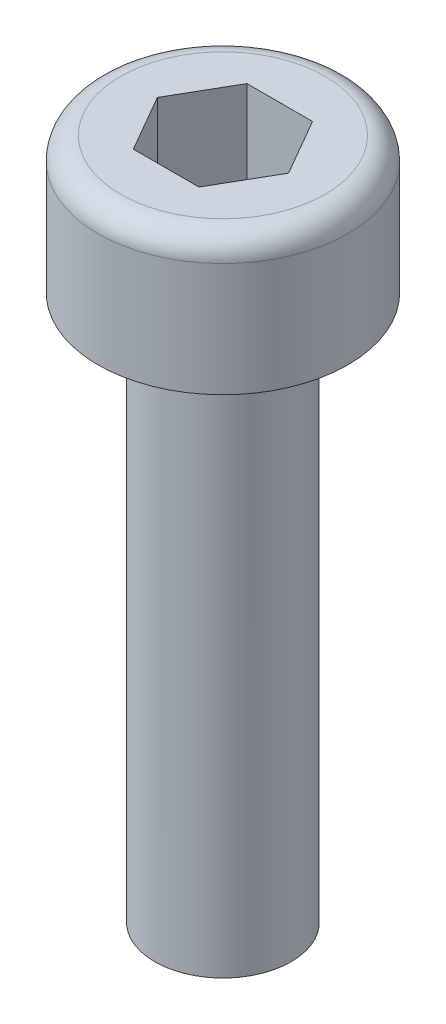
ISO-10303-21;
HEADER;
FILE_DESCRIPTION(('STEP AP214'),'2;1');
FILE_NAME('part.step','',(''),(''),'','','');
FILE_SCHEMA(('AUTOMOTIVE_DESIGN { 1 0 10303 214 1 1 1 1 }'));
ENDSEC;
DATA;
#1=APPLICATION_CONTEXT('core data for automotive mechanical design processes');
#2=APPLICATION_PROTOCOL_DEFINITION('international standard','automotive_design',2000,#1);
#3=PRODUCT_CONTEXT('',#1,'mechanical');
#4=PRODUCT('Part','Part','',(#3));
#5=PRODUCT_RELATED_PRODUCT_CATEGORY('part','',(#4));
#6=PRODUCT_DEFINITION_FORMATION('','',#4);
#7=PRODUCT_DEFINITION_CONTEXT('part definition',#1,'design');
#8=PRODUCT_DEFINITION('design','',#6,#7);
#9=PRODUCT_DEFINITION_SHAPE('','',#8);
#10=(LENGTH_UNIT() NAMED_UNIT(*) SI_UNIT(.MILLI.,.METRE.));
#11=(NAMED_UNIT(*) PLANE_ANGLE_UNIT() SI_UNIT($,.RADIAN.));
#12=(NAMED_UNIT(*) SI_UNIT($,.STERADIAN.) SOLID_ANGLE_UNIT());
#13=UNCERTAINTY_MEASURE_WITH_UNIT(LENGTH_MEASURE(1.E-05),#10,'distance_accuracy_value','');
#14=(GEOMETRIC_REPRESENTATION_CONTEXT(3) GLOBAL_UNCERTAINTY_ASSIGNED_CONTEXT((#13)) GLOBAL_UNIT_ASSIGNED_CONTEXT((#10,
#11,#12)) REPRESENTATION_CONTEXT('',''));
#15=CARTESIAN_POINT('',(0.,0.,0.));
#16=DIRECTION('',(0.,0.,1.));
#17=DIRECTION('',(1.,0.,0.));
#18=AXIS2_PLACEMENT_3D('',#15,#16,#17);
#19=CARTESIAN_POINT('',(0.,2.5,0.));
#20=DIRECTION('',(0.,-1.,0.));
#21=DIRECTION('',(1.,0.,0.));
#22=AXIS2_PLACEMENT_3D('',#19,#20,#21);
#23=TOROIDAL_SURFACE('',#22,2.25,0.5);
#24=CARTESIAN_POINT('',(0.,3.,0.));
#25=DIRECTION('',(0.,-1.,0.));
#26=DIRECTION('',(1.,0.,0.));
#27=AXIS2_PLACEMENT_3D('',#24,#25,#26);
#28=CIRCLE('',#27,2.25);
#29=CARTESIAN_POINT('',(2.25,3.,0.));
#30=VERTEX_POINT('',#29);
#31=EDGE_CURVE('E136',#30,#30,#28,.T.);
#32=ORIENTED_EDGE('',*,*,#31,.T.);
#33=EDGE_LOOP('',(#32));
#34=FACE_BOUND('',#33,.T.);
#35=CARTESIAN_POINT('',(0.,2.5,0.));
#36=DIRECTION('',(0.,-1.,0.));
#37=DIRECTION('',(1.,0.,0.));
#38=AXIS2_PLACEMENT_3D('',#35,#36,#37);
#39=CIRCLE('',#38,2.75);
#40=CARTESIAN_POINT('',(2.75,2.5,0.));
#41=VERTEX_POINT('',#40);
#42=EDGE_CURVE('E11',#41,#41,#39,.T.);
#43=ORIENTED_EDGE('',*,*,#42,.F.);
#44=EDGE_LOOP('',(#43));
#45=FACE_BOUND('',#44,.T.);
#46=ADVANCED_FACE('F33',(#34,#45),#23,.T.);
#47=CARTESIAN_POINT('',(0.,3.,0.));
#48=DIRECTION('',(0.,-1.,0.));
#49=DIRECTION('',(1.,0.,0.));
#50=AXIS2_PLACEMENT_3D('',#47,#48,#49);
#51=CYLINDRICAL_SURFACE('',#50,2.75);
#52=ORIENTED_EDGE('',*,*,#42,.T.);
#53=EDGE_LOOP('',(#52));
#54=FACE_BOUND('',#53,.T.);
#55=CARTESIAN_POINT('',(0.,0.,0.));
#56=DIRECTION('',(0.,-1.,0.));
#57=DIRECTION('',(1.,0.,0.));
#58=AXIS2_PLACEMENT_3D('',#55,#56,#57);
#59=CIRCLE('',#58,2.75);
#60=CARTESIAN_POINT('',(2.75,0.,0.));
#61=VERTEX_POINT('',#60);
#62=EDGE_CURVE('E40',#61,#61,#59,.T.);
#63=ORIENTED_EDGE('',*,*,#62,.F.);
#64=EDGE_LOOP('',(#63));
#65=FACE_BOUND('',#64,.T.);
#66=ADVANCED_FACE('F156',(#54,#65),#51,.T.);
#67=CARTESIAN_POINT('',(2.74999999999984,0.,0.));
#68=DIRECTION('',(0.,-1.,0.));
#69=DIRECTION('',(1.,0.,0.));
#70=AXIS2_PLACEMENT_3D('',#67,#68,#69);
#71=PLANE('',#70);
#72=ORIENTED_EDGE('',*,*,#62,.T.);
#73=EDGE_LOOP('',(#72));
#74=FACE_BOUND('',#73,.T.);
#75=CARTESIAN_POINT('',(0.,0.,0.));
#76=DIRECTION('',(0.,-1.,0.));
#77=DIRECTION('',(1.,0.,0.));
#78=AXIS2_PLACEMENT_3D('',#75,#76,#77);
#79=CIRCLE('',#78,1.5);
#80=CARTESIAN_POINT('',(1.5,0.,0.));
#81=VERTEX_POINT('',#80);
#82=EDGE_CURVE('E148',#81,#81,#79,.T.);
#83=ORIENTED_EDGE('',*,*,#82,.F.);
#84=EDGE_LOOP('',(#83));
#85=FACE_BOUND('',#84,.T.);
#86=ADVANCED_FACE('F153',(#74,#85),#71,.T.);
#87=CARTESIAN_POINT('',(0.,3.,0.));
#88=DIRECTION('',(0.,-1.,0.));
#89=DIRECTION('',(1.,0.,0.));
#90=AXIS2_PLACEMENT_3D('',#87,#88,#89);
#91=CYLINDRICAL_SURFACE('',#90,1.5);
#92=ORIENTED_EDGE('',*,*,#82,.T.);
#93=EDGE_LOOP('',(#92));
#94=FACE_BOUND('',#93,.T.);
#95=CARTESIAN_POINT('',(0.,-12.,0.));
#96=DIRECTION('',(0.,-1.,0.));
#97=DIRECTION('',(1.,0.,0.));
#98=AXIS2_PLACEMENT_3D('',#95,#96,#97);
#99=CIRCLE('',#98,1.5);
#100=CARTESIAN_POINT('',(1.5,-12.,0.));
#101=VERTEX_POINT('',#100);
#102=EDGE_CURVE('E145',#101,#101,#99,.T.);
#103=ORIENTED_EDGE('',*,*,#102,.F.);
#104=EDGE_LOOP('',(#103));
#105=FACE_BOUND('',#104,.T.);
#106=ADVANCED_FACE('F163',(#94,#105),#91,.T.);
#107=CARTESIAN_POINT('',(0.,-12.4019237886467,0.));
#108=DIRECTION('',(0.,1.,0.));
#109=DIRECTION('',(-1.,0.,0.));
#110=AXIS2_PLACEMENT_3D('',#107,#108,#109);
#111=CONICAL_SURFACE('',#110,0.,1.30899693899574);
#112=ORIENTED_EDGE('',*,*,#102,.T.);
#113=EDGE_LOOP('',(#112));
#114=FACE_BOUND('',#113,.T.);
#115=CARTESIAN_POINT('',(0.,-12.4019237886467,0.));
#116=VERTEX_POINT('',#115);
#117=VERTEX_LOOP('',#116);
#118=FACE_BOUND('',#117,.T.);
#119=ADVANCED_FACE('F169',(#114,#118),#111,.T.);
#120=CARTESIAN_POINT('',(0.,3.,0.));
#121=DIRECTION('',(0.,1.,0.));
#122=DIRECTION('',(-1.,0.,0.));
#123=AXIS2_PLACEMENT_3D('',#120,#121,#122);
#124=PLANE('',#123);
#125=DIRECTION('',(0.500000000000002,0.,-0.866025403784441));
#126=VECTOR('',#125,1.);
#127=CARTESIAN_POINT('',(0.721687836486983,3.,1.25000000000002));
#128=LINE('',#127,#126);
#129=CARTESIAN_POINT('',(0.721687836486983,3.,1.25000000000002));
#130=VERTEX_POINT('',#129);
#131=CARTESIAN_POINT('',(1.44337567297406,3.,0.));
#132=VERTEX_POINT('',#131);
#133=EDGE_CURVE('E47',#130,#132,#128,.T.);
#134=ORIENTED_EDGE('',*,*,#133,.F.);
#135=DIRECTION('',(1.,0.,0.));
#136=VECTOR('',#135,1.);
#137=CARTESIAN_POINT('',(-0.721687836487191,3.,1.25000000000003));
#138=LINE('',#137,#136);
#139=CARTESIAN_POINT('',(-0.721687836487191,3.,1.25000000000003));
#140=VERTEX_POINT('',#139);
#141=EDGE_CURVE('E116',#140,#130,#138,.T.);
#142=ORIENTED_EDGE('',*,*,#141,.F.);
#143=DIRECTION('',(0.5,0.,0.866025403784441));
#144=VECTOR('',#143,1.);
#145=CARTESIAN_POINT('',(-1.44337567297423,3.,0.));
#146=LINE('',#145,#144);
#147=CARTESIAN_POINT('',(-1.44337567297423,3.,0.));
#148=VERTEX_POINT('',#147);
#149=EDGE_CURVE('E110',#148,#140,#146,.T.);
#150=ORIENTED_EDGE('',*,*,#149,.F.);
#151=DIRECTION('',(-0.500000000000002,0.,0.866025403784441));
#152=VECTOR('',#151,1.);
#153=CARTESIAN_POINT('',(-0.721687836487205,3.,-1.24999999999998));
#154=LINE('',#153,#152);
#155=CARTESIAN_POINT('',(-0.721687836487205,3.,-1.24999999999998));
#156=VERTEX_POINT('',#155);
#157=EDGE_CURVE('E108',#156,#148,#154,.T.);
#158=ORIENTED_EDGE('',*,*,#157,.F.);
#159=DIRECTION('',(-1.,0.,0.));
#160=VECTOR('',#159,1.);
#161=CARTESIAN_POINT('',(0.721687836486892,3.,-1.24999999999999));
#162=LINE('',#161,#160);
#163=CARTESIAN_POINT('',(0.721687836486892,3.,-1.24999999999999));
#164=VERTEX_POINT('',#163);
#165=EDGE_CURVE('E89',#164,#156,#162,.T.);
#166=ORIENTED_EDGE('',*,*,#165,.F.);
#167=DIRECTION('',(-0.500000000000001,0.,-0.866025403784442));
#168=VECTOR('',#167,1.);
#169=CARTESIAN_POINT('',(1.44337567297406,3.,0.));
#170=LINE('',#169,#168);
#171=EDGE_CURVE('E100',#132,#164,#170,.T.);
#172=ORIENTED_EDGE('',*,*,#171,.F.);
#173=EDGE_LOOP('',(#134,#142,#150,#158,#166,#172));
#174=FACE_BOUND('',#173,.T.);
#175=ORIENTED_EDGE('',*,*,#31,.F.);
#176=EDGE_LOOP('',(#175));
#177=FACE_BOUND('',#176,.T.);
#178=ADVANCED_FACE('F104',(#174,#177),#124,.T.);
#179=CARTESIAN_POINT('',(0.721687836486983,1.,1.25000000000002));
#180=DIRECTION('',(0.866025403784441,0.,0.500000000000002));
#181=DIRECTION('',(0.500000000000002,0.,-0.866025403784441));
#182=AXIS2_PLACEMENT_3D('',#179,#180,#181);
#183=PLANE('',#182);
#184=ORIENTED_EDGE('',*,*,#133,.T.);
#185=DIRECTION('',(0.,1.,0.));
#186=VECTOR('',#185,1.);
#187=CARTESIAN_POINT('',(1.44337567297406,1.,0.));
#188=LINE('',#187,#186);
#189=CARTESIAN_POINT('',(1.44337567297406,1.,0.));
#190=VERTEX_POINT('',#189);
#191=EDGE_CURVE('E97',#190,#132,#188,.T.);
#192=ORIENTED_EDGE('',*,*,#191,.F.);
#193=DIRECTION('',(0.500000000000002,0.,-0.866025403784441));
#194=VECTOR('',#193,1.);
#195=CARTESIAN_POINT('',(0.721687836486983,1.,1.25000000000002));
#196=LINE('',#195,#194);
#197=CARTESIAN_POINT('',(0.721687836486983,1.,1.25000000000002));
#198=VERTEX_POINT('',#197);
#199=EDGE_CURVE('E119',#198,#190,#196,.T.);
#200=ORIENTED_EDGE('',*,*,#199,.F.);
#201=DIRECTION('',(0.,1.,0.));
#202=VECTOR('',#201,1.);
#203=CARTESIAN_POINT('',(0.721687836486983,1.,1.25000000000002));
#204=LINE('',#203,#202);
#205=EDGE_CURVE('E134',#198,#130,#204,.T.);
#206=ORIENTED_EDGE('',*,*,#205,.T.);
#207=EDGE_LOOP('',(#184,#192,#200,#206));
#208=FACE_BOUND('',#207,.T.);
#209=ADVANCED_FACE('F176',(#208),#183,.F.);
#210=CARTESIAN_POINT('',(-0.721687836487191,1.,1.25000000000003));
#211=DIRECTION('',(0.,0.,1.));
#212=DIRECTION('',(1.,0.,0.));
#213=AXIS2_PLACEMENT_3D('',#210,#211,#212);
#214=PLANE('',#213);
#215=ORIENTED_EDGE('',*,*,#141,.T.);
#216=ORIENTED_EDGE('',*,*,#205,.F.);
#217=DIRECTION('',(1.,0.,0.));
#218=VECTOR('',#217,1.);
#219=CARTESIAN_POINT('',(-0.721687836487191,1.,1.25000000000003));
#220=LINE('',#219,#218);
#221=CARTESIAN_POINT('',(-0.721687836487191,1.,1.25000000000003));
#222=VERTEX_POINT('',#221);
#223=EDGE_CURVE('E131',#222,#198,#220,.T.);
#224=ORIENTED_EDGE('',*,*,#223,.F.);
#225=DIRECTION('',(0.,1.,0.));
#226=VECTOR('',#225,1.);
#227=CARTESIAN_POINT('',(-0.721687836487191,1.,1.25000000000003));
#228=LINE('',#227,#226);
#229=EDGE_CURVE('E137',#222,#140,#228,.T.);
#230=ORIENTED_EDGE('',*,*,#229,.T.);
#231=EDGE_LOOP('',(#215,#216,#224,#230));
#232=FACE_BOUND('',#231,.T.);
#233=ADVANCED_FACE('F179',(#232),#214,.F.);
#234=CARTESIAN_POINT('',(-1.44337567297423,1.,0.));
#235=DIRECTION('',(-0.866025403784441,0.,0.5));
#236=DIRECTION('',(0.5,0.,0.866025403784439));
#237=AXIS2_PLACEMENT_3D('',#234,#235,#236);
#238=PLANE('',#237);
#239=ORIENTED_EDGE('',*,*,#149,.T.);
#240=ORIENTED_EDGE('',*,*,#229,.F.);
#241=DIRECTION('',(0.5,0.,0.866025403784441));
#242=VECTOR('',#241,1.);
#243=CARTESIAN_POINT('',(-1.44337567297423,1.,0.));
#244=LINE('',#243,#242);
#245=CARTESIAN_POINT('',(-1.44337567297423,1.,0.));
#246=VERTEX_POINT('',#245);
#247=EDGE_CURVE('E128',#246,#222,#244,.T.);
#248=ORIENTED_EDGE('',*,*,#247,.F.);
#249=DIRECTION('',(0.,1.,0.));
#250=VECTOR('',#249,1.);
#251=CARTESIAN_POINT('',(-1.44337567297423,1.,0.));
#252=LINE('',#251,#250);
#253=EDGE_CURVE('E139',#246,#148,#252,.T.);
#254=ORIENTED_EDGE('',*,*,#253,.T.);
#255=EDGE_LOOP('',(#239,#240,#248,#254));
#256=FACE_BOUND('',#255,.T.);
#257=ADVANCED_FACE('F188',(#256),#238,.F.);
#258=CARTESIAN_POINT('',(-0.721687836487205,1.,-1.24999999999998));
#259=DIRECTION('',(-0.866025403784441,0.,-0.500000000000002));
#260=DIRECTION('',(-0.500000000000002,0.,0.866025403784441));
#261=AXIS2_PLACEMENT_3D('',#258,#259,#260);
#262=PLANE('',#261);
#263=ORIENTED_EDGE('',*,*,#157,.T.);
#264=ORIENTED_EDGE('',*,*,#253,.F.);
#265=DIRECTION('',(-0.500000000000002,0.,0.866025403784441));
#266=VECTOR('',#265,1.);
#267=CARTESIAN_POINT('',(-0.721687836487205,1.,-1.24999999999998));
#268=LINE('',#267,#266);
#269=CARTESIAN_POINT('',(-0.721687836487205,1.,-1.24999999999998));
#270=VERTEX_POINT('',#269);
#271=EDGE_CURVE('E125',#270,#246,#268,.T.);
#272=ORIENTED_EDGE('',*,*,#271,.F.);
#273=DIRECTION('',(0.,1.,0.));
#274=VECTOR('',#273,1.);
#275=CARTESIAN_POINT('',(-0.721687836487205,1.,-1.24999999999998));
#276=LINE('',#275,#274);
#277=EDGE_CURVE('E96',#270,#156,#276,.T.);
#278=ORIENTED_EDGE('',*,*,#277,.T.);
#279=EDGE_LOOP('',(#263,#264,#272,#278));
#280=FACE_BOUND('',#279,.T.);
#281=ADVANCED_FACE('F185',(#280),#262,.F.);
#282=CARTESIAN_POINT('',(0.721687836486892,1.,-1.24999999999999));
#283=DIRECTION('',(0.,0.,-1.));
#284=DIRECTION('',(-1.,0.,0.));
#285=AXIS2_PLACEMENT_3D('',#282,#283,#284);
#286=PLANE('',#285);
#287=ORIENTED_EDGE('',*,*,#165,.T.);
#288=ORIENTED_EDGE('',*,*,#277,.F.);
#289=DIRECTION('',(-1.,0.,0.));
#290=VECTOR('',#289,1.);
#291=CARTESIAN_POINT('',(0.721687836486892,1.,-1.24999999999999));
#292=LINE('',#291,#290);
#293=CARTESIAN_POINT('',(0.721687836486892,1.,-1.24999999999999));
#294=VERTEX_POINT('',#293);
#295=EDGE_CURVE('E92',#294,#270,#292,.T.);
#296=ORIENTED_EDGE('',*,*,#295,.F.);
#297=DIRECTION('',(0.,1.,0.));
#298=VECTOR('',#297,1.);
#299=CARTESIAN_POINT('',(0.721687836486892,1.,-1.24999999999999));
#300=LINE('',#299,#298);
#301=EDGE_CURVE('E85',#294,#164,#300,.T.);
#302=ORIENTED_EDGE('',*,*,#301,.T.);
#303=EDGE_LOOP('',(#287,#288,#296,#302));
#304=FACE_BOUND('',#303,.T.);
#305=ADVANCED_FACE('F87',(#304),#286,.F.);
#306=CARTESIAN_POINT('',(1.44337567297406,1.,0.));
#307=DIRECTION('',(0.866025403784442,0.,-0.500000000000001));
#308=DIRECTION('',(-0.500000000000001,0.,-0.866025403784442));
#309=AXIS2_PLACEMENT_3D('',#306,#307,#308);
#310=PLANE('',#309);
#311=ORIENTED_EDGE('',*,*,#171,.T.);
#312=ORIENTED_EDGE('',*,*,#301,.F.);
#313=DIRECTION('',(-0.500000000000001,0.,-0.866025403784442));
#314=VECTOR('',#313,1.);
#315=CARTESIAN_POINT('',(1.44337567297406,1.,0.));
#316=LINE('',#315,#314);
#317=EDGE_CURVE('E122',#190,#294,#316,.T.);
#318=ORIENTED_EDGE('',*,*,#317,.F.);
#319=ORIENTED_EDGE('',*,*,#191,.T.);
#320=EDGE_LOOP('',(#311,#312,#318,#319));
#321=FACE_BOUND('',#320,.T.);
#322=ADVANCED_FACE('F101',(#321),#310,.F.);
#323=CARTESIAN_POINT('',(0.721687836486983,1.,1.25000000000002));
#324=DIRECTION('',(0.,-1.,0.));
#325=DIRECTION('',(0.,0.,-1.));
#326=AXIS2_PLACEMENT_3D('',#323,#324,#325);
#327=PLANE('',#326);
#328=ORIENTED_EDGE('',*,*,#199,.T.);
#329=ORIENTED_EDGE('',*,*,#317,.T.);
#330=ORIENTED_EDGE('',*,*,#295,.T.);
#331=ORIENTED_EDGE('',*,*,#271,.T.);
#332=ORIENTED_EDGE('',*,*,#247,.T.);
#333=ORIENTED_EDGE('',*,*,#223,.T.);
#334=EDGE_LOOP('',(#328,#329,#330,#331,#332,#333));
#335=FACE_BOUND('',#334,.T.);
#336=ADVANCED_FACE('F182',(#335),#327,.F.);
#337=CLOSED_SHELL('',(#46,#66,#86,#106,#119,#178,#209,#233,#257,#281,#305,#322,#336));
#338=MANIFOLD_SOLID_BREP('B2',#337);
#339=ADVANCED_BREP_SHAPE_REPRESENTATION('',(#18,#338),#14);
#340=SHAPE_DEFINITION_REPRESENTATION(#9,#339);
ENDSEC;
END-ISO-10303-21;
